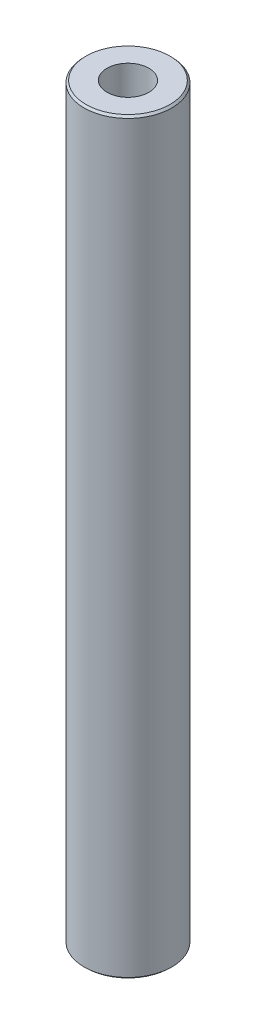
ISO-10303-21;
HEADER;
FILE_DESCRIPTION(('STEP AP214'),'2;1');
FILE_NAME('part.step','',(''),(''),'','','');
FILE_SCHEMA(('AUTOMOTIVE_DESIGN { 1 0 10303 214 1 1 1 1 }'));
ENDSEC;
DATA;
#1=APPLICATION_CONTEXT('core data for automotive mechanical design processes');
#2=APPLICATION_PROTOCOL_DEFINITION('international standard','automotive_design',2000,#1);
#3=PRODUCT_CONTEXT('',#1,'mechanical');
#4=PRODUCT('Part','Part','',(#3));
#5=PRODUCT_RELATED_PRODUCT_CATEGORY('part','',(#4));
#6=PRODUCT_DEFINITION_FORMATION('','',#4);
#7=PRODUCT_DEFINITION_CONTEXT('part definition',#1,'design');
#8=PRODUCT_DEFINITION('design','',#6,#7);
#9=PRODUCT_DEFINITION_SHAPE('','',#8);
#10=(LENGTH_UNIT() NAMED_UNIT(*) SI_UNIT(.MILLI.,.METRE.));
#11=(NAMED_UNIT(*) PLANE_ANGLE_UNIT() SI_UNIT($,.RADIAN.));
#12=(NAMED_UNIT(*) SI_UNIT($,.STERADIAN.) SOLID_ANGLE_UNIT());
#13=UNCERTAINTY_MEASURE_WITH_UNIT(LENGTH_MEASURE(1.E-05),#10,'distance_accuracy_value','');
#14=(GEOMETRIC_REPRESENTATION_CONTEXT(3) GLOBAL_UNCERTAINTY_ASSIGNED_CONTEXT((#13)) GLOBAL_UNIT_ASSIGNED_CONTEXT((#10,
#11,#12)) REPRESENTATION_CONTEXT('',''));
#15=CARTESIAN_POINT('',(0.,0.,0.));
#16=DIRECTION('',(0.,0.,1.));
#17=DIRECTION('',(1.,0.,0.));
#18=AXIS2_PLACEMENT_3D('',#15,#16,#17);
#19=CARTESIAN_POINT('',(0.,554.067737339318,0.));
#20=DIRECTION('',(0.,-1.,0.));
#21=DIRECTION('',(0.,0.,-1.));
#22=AXIS2_PLACEMENT_3D('',#19,#20,#21);
#23=CYLINDRICAL_SURFACE('',#22,32.5);
#24=CARTESIAN_POINT('',(0.,552.555223364138,0.));
#25=DIRECTION('',(0.,1.,0.));
#26=DIRECTION('',(0.,0.,1.));
#27=AXIS2_PLACEMENT_3D('',#24,#25,#26);
#28=CIRCLE('',#27,32.5);
#29=CARTESIAN_POINT('',(0.,552.555223364138,32.5));
#30=VERTEX_POINT('',#29);
#31=EDGE_CURVE('E50',#30,#30,#28,.F.);
#32=ORIENTED_EDGE('',*,*,#31,.T.);
#33=EDGE_LOOP('',(#32));
#34=FACE_BOUND('',#33,.T.);
#35=CARTESIAN_POINT('',(0.,1.39756375706168,0.));
#36=DIRECTION('',(0.,1.,0.));
#37=DIRECTION('',(0.,0.,1.));
#38=AXIS2_PLACEMENT_3D('',#35,#36,#37);
#39=CIRCLE('',#38,32.5);
#40=CARTESIAN_POINT('',(0.,1.39756375706168,32.5));
#41=VERTEX_POINT('',#40);
#42=EDGE_CURVE('E51',#41,#41,#39,.T.);
#43=ORIENTED_EDGE('',*,*,#42,.T.);
#44=EDGE_LOOP('',(#43));
#45=FACE_BOUND('',#44,.T.);
#46=ADVANCED_FACE('F39',(#34,#45),#23,.T.);
#47=CARTESIAN_POINT('',(0.,554.067737339318,0.));
#48=DIRECTION('',(0.,1.,0.));
#49=DIRECTION('',(0.,0.,1.));
#50=AXIS2_PLACEMENT_3D('',#47,#48,#49);
#51=PLANE('',#50);
#52=CARTESIAN_POINT('',(0.,554.067737339318,0.));
#53=DIRECTION('',(0.,1.,0.));
#54=DIRECTION('',(0.,0.,1.));
#55=AXIS2_PLACEMENT_3D('',#52,#53,#54);
#56=CIRCLE('',#55,31.1024362429382);
#57=CARTESIAN_POINT('',(0.,554.067737339318,31.1024362429382));
#58=VERTEX_POINT('',#57);
#59=EDGE_CURVE('E54',#58,#58,#56,.T.);
#60=ORIENTED_EDGE('',*,*,#59,.T.);
#61=EDGE_LOOP('',(#60));
#62=FACE_BOUND('',#61,.T.);
#63=CARTESIAN_POINT('',(0.,554.067737339318,0.));
#64=DIRECTION('',(0.,1.,0.));
#65=DIRECTION('',(0.,0.,1.));
#66=AXIS2_PLACEMENT_3D('',#63,#64,#65);
#67=CIRCLE('',#66,15.5087941261244);
#68=CARTESIAN_POINT('',(0.,554.067737339318,15.5087941261244));
#69=VERTEX_POINT('',#68);
#70=EDGE_CURVE('E58',#69,#69,#67,.T.);
#71=ORIENTED_EDGE('',*,*,#70,.F.);
#72=EDGE_LOOP('',(#71));
#73=FACE_BOUND('',#72,.T.);
#74=ADVANCED_FACE('F69',(#62,#73),#51,.T.);
#75=CARTESIAN_POINT('',(0.,0.,0.));
#76=DIRECTION('',(0.,1.,0.));
#77=DIRECTION('',(0.,0.,1.));
#78=AXIS2_PLACEMENT_3D('',#75,#76,#77);
#79=PLANE('',#78);
#80=CARTESIAN_POINT('',(0.,0.,0.));
#81=DIRECTION('',(0.,1.,0.));
#82=DIRECTION('',(0.,0.,1.));
#83=AXIS2_PLACEMENT_3D('',#80,#81,#82);
#84=CIRCLE('',#83,30.98748602482);
#85=CARTESIAN_POINT('',(0.,0.,30.98748602482));
#86=VERTEX_POINT('',#85);
#87=EDGE_CURVE('E10',#86,#86,#84,.F.);
#88=ORIENTED_EDGE('',*,*,#87,.T.);
#89=EDGE_LOOP('',(#88));
#90=FACE_BOUND('',#89,.T.);
#91=CARTESIAN_POINT('',(0.,0.,0.));
#92=DIRECTION('',(0.,1.,0.));
#93=DIRECTION('',(0.,0.,1.));
#94=AXIS2_PLACEMENT_3D('',#91,#92,#93);
#95=CIRCLE('',#94,15.5087941261244);
#96=CARTESIAN_POINT('',(0.,0.,15.5087941261244));
#97=VERTEX_POINT('',#96);
#98=EDGE_CURVE('E63',#97,#97,#95,.T.);
#99=ORIENTED_EDGE('',*,*,#98,.T.);
#100=EDGE_LOOP('',(#99));
#101=FACE_BOUND('',#100,.T.);
#102=ADVANCED_FACE('F75',(#90,#101),#79,.F.);
#103=CARTESIAN_POINT('',(0.,554.067737339318,0.));
#104=DIRECTION('',(0.,-1.,0.));
#105=DIRECTION('',(0.,0.,-1.));
#106=AXIS2_PLACEMENT_3D('',#103,#104,#105);
#107=CYLINDRICAL_SURFACE('',#106,15.5087941261244);
#108=ORIENTED_EDGE('',*,*,#70,.T.);
#109=EDGE_LOOP('',(#108));
#110=FACE_BOUND('',#109,.T.);
#111=ORIENTED_EDGE('',*,*,#98,.F.);
#112=EDGE_LOOP('',(#111));
#113=FACE_BOUND('',#112,.T.);
#114=ADVANCED_FACE('F70',(#110,#113),#107,.F.);
#115=CARTESIAN_POINT('',(0.,554.067737339318,0.));
#116=DIRECTION('',(0.,-1.,0.));
#117=DIRECTION('',(0.,0.,-1.));
#118=AXIS2_PLACEMENT_3D('',#115,#116,#117);
#119=CONICAL_SURFACE('',#118,31.1024362429382,0.745917950608896);
#120=ORIENTED_EDGE('',*,*,#31,.F.);
#121=EDGE_LOOP('',(#120));
#122=FACE_BOUND('',#121,.T.);
#123=ORIENTED_EDGE('',*,*,#59,.F.);
#124=EDGE_LOOP('',(#123));
#125=FACE_BOUND('',#124,.T.);
#126=ADVANCED_FACE('F81',(#122,#125),#119,.T.);
#127=CARTESIAN_POINT('',(0.,1.39756375706168,0.));
#128=DIRECTION('',(0.,1.,0.));
#129=DIRECTION('',(0.,0.,1.));
#130=AXIS2_PLACEMENT_3D('',#127,#128,#129);
#131=CONICAL_SURFACE('',#130,32.5,0.824878376185985);
#132=ORIENTED_EDGE('',*,*,#87,.F.);
#133=EDGE_LOOP('',(#132));
#134=FACE_BOUND('',#133,.T.);
#135=ORIENTED_EDGE('',*,*,#42,.F.);
#136=EDGE_LOOP('',(#135));
#137=FACE_BOUND('',#136,.T.);
#138=ADVANCED_FACE('F45',(#134,#137),#131,.T.);
#139=CLOSED_SHELL('',(#46,#74,#102,#114,#126,#138));
#140=MANIFOLD_SOLID_BREP('B2',#139);
#141=ADVANCED_BREP_SHAPE_REPRESENTATION('',(#18,#140),#14);
#142=SHAPE_DEFINITION_REPRESENTATION(#9,#141);
ENDSEC;
END-ISO-10303-21;
